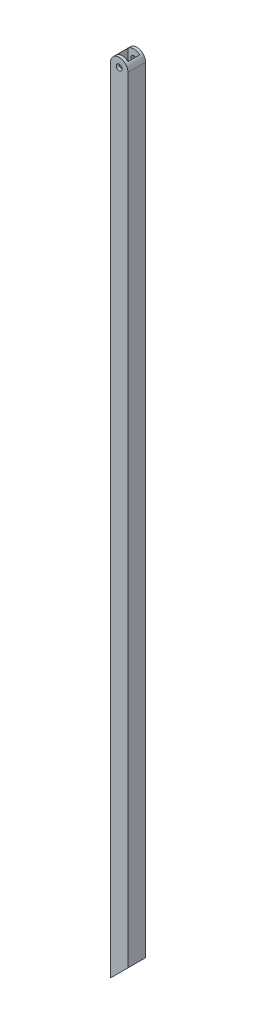
ISO-10303-21;
HEADER;
FILE_DESCRIPTION(('STEP AP214'),'2;1');
FILE_NAME('part.step','',(''),(''),'','','');
FILE_SCHEMA(('AUTOMOTIVE_DESIGN { 1 0 10303 214 1 1 1 1 }'));
ENDSEC;
DATA;
#1=APPLICATION_CONTEXT('core data for automotive mechanical design processes');
#2=APPLICATION_PROTOCOL_DEFINITION('international standard','automotive_design',2000,#1);
#3=PRODUCT_CONTEXT('',#1,'mechanical');
#4=PRODUCT('Part','Part','',(#3));
#5=PRODUCT_RELATED_PRODUCT_CATEGORY('part','',(#4));
#6=PRODUCT_DEFINITION_FORMATION('','',#4);
#7=PRODUCT_DEFINITION_CONTEXT('part definition',#1,'design');
#8=PRODUCT_DEFINITION('design','',#6,#7);
#9=PRODUCT_DEFINITION_SHAPE('','',#8);
#10=(LENGTH_UNIT() NAMED_UNIT(*) SI_UNIT(.MILLI.,.METRE.));
#11=(NAMED_UNIT(*) PLANE_ANGLE_UNIT() SI_UNIT($,.RADIAN.));
#12=(NAMED_UNIT(*) SI_UNIT($,.STERADIAN.) SOLID_ANGLE_UNIT());
#13=UNCERTAINTY_MEASURE_WITH_UNIT(LENGTH_MEASURE(1.E-05),#10,'distance_accuracy_value','');
#14=(GEOMETRIC_REPRESENTATION_CONTEXT(3) GLOBAL_UNCERTAINTY_ASSIGNED_CONTEXT((#13)) GLOBAL_UNIT_ASSIGNED_CONTEXT((#10,
#11,#12)) REPRESENTATION_CONTEXT('',''));
#15=CARTESIAN_POINT('',(0.,0.,0.));
#16=DIRECTION('',(0.,0.,1.));
#17=DIRECTION('',(1.,0.,0.));
#18=AXIS2_PLACEMENT_3D('',#15,#16,#17);
#19=CARTESIAN_POINT('',(0.,0.,19.05));
#20=DIRECTION('',(-0.707106781186549,0.707106781186546,0.));
#21=DIRECTION('',(-0.707106781186546,-0.707106781186549,0.));
#22=AXIS2_PLACEMENT_3D('',#19,#20,#21);
#23=PLANE('',#22);
#24=DIRECTION('',(0.707106781186546,0.707106781186549,0.));
#25=VECTOR('',#24,1.);
#26=CARTESIAN_POINT('',(0.,0.,0.));
#27=LINE('',#26,#25);
#28=CARTESIAN_POINT('',(0.,0.,0.));
#29=VERTEX_POINT('',#28);
#30=CARTESIAN_POINT('',(19.05,19.0500000000001,0.));
#31=VERTEX_POINT('',#30);
#32=EDGE_CURVE('E147',#29,#31,#27,.T.);
#33=ORIENTED_EDGE('',*,*,#32,.T.);
#34=DIRECTION('',(0.,0.,-1.));
#35=VECTOR('',#34,1.);
#36=CARTESIAN_POINT('',(19.05,19.0500000000001,19.05));
#37=LINE('',#36,#35);
#38=CARTESIAN_POINT('',(19.05,19.0500000000001,19.05));
#39=VERTEX_POINT('',#38);
#40=EDGE_CURVE('E128',#39,#31,#37,.T.);
#41=ORIENTED_EDGE('',*,*,#40,.F.);
#42=DIRECTION('',(0.707106781186546,0.707106781186549,0.));
#43=VECTOR('',#42,1.);
#44=CARTESIAN_POINT('',(0.,0.,19.05));
#45=LINE('',#44,#43);
#46=CARTESIAN_POINT('',(0.,0.,19.05));
#47=VERTEX_POINT('',#46);
#48=EDGE_CURVE('E86',#47,#39,#45,.T.);
#49=ORIENTED_EDGE('',*,*,#48,.F.);
#50=DIRECTION('',(0.,0.,-1.));
#51=VECTOR('',#50,1.);
#52=CARTESIAN_POINT('',(0.,0.,19.05));
#53=LINE('',#52,#51);
#54=EDGE_CURVE('E127',#47,#29,#53,.T.);
#55=ORIENTED_EDGE('',*,*,#54,.T.);
#56=EDGE_LOOP('',(#33,#41,#49,#55));
#57=FACE_BOUND('',#56,.T.);
#58=DIRECTION('',(0.,0.,-1.));
#59=VECTOR('',#58,1.);
#60=CARTESIAN_POINT('',(3.175,3.17500000000001,19.05));
#61=LINE('',#60,#59);
#62=CARTESIAN_POINT('',(3.17500000000004,3.17500000000012,15.875));
#63=VERTEX_POINT('',#62);
#64=CARTESIAN_POINT('',(3.175,3.17500000000001,3.175));
#65=VERTEX_POINT('',#64);
#66=EDGE_CURVE('E121',#63,#65,#61,.T.);
#67=ORIENTED_EDGE('',*,*,#66,.F.);
#68=DIRECTION('',(-0.707106781186546,-0.707106781186549,0.));
#69=VECTOR('',#68,1.);
#70=CARTESIAN_POINT('',(0.,0.,15.875));
#71=LINE('',#70,#69);
#72=CARTESIAN_POINT('',(15.875,15.8750000000003,15.875));
#73=VERTEX_POINT('',#72);
#74=EDGE_CURVE('E166',#73,#63,#71,.T.);
#75=ORIENTED_EDGE('',*,*,#74,.F.);
#76=DIRECTION('',(0.,0.,1.));
#77=VECTOR('',#76,1.);
#78=CARTESIAN_POINT('',(15.875,15.8750000000001,19.05));
#79=LINE('',#78,#77);
#80=CARTESIAN_POINT('',(15.8749999999999,15.8749999999997,3.175));
#81=VERTEX_POINT('',#80);
#82=EDGE_CURVE('E164',#81,#73,#79,.T.);
#83=ORIENTED_EDGE('',*,*,#82,.F.);
#84=DIRECTION('',(0.707106781186546,0.707106781186549,0.));
#85=VECTOR('',#84,1.);
#86=CARTESIAN_POINT('',(0.,0.,3.175));
#87=LINE('',#86,#85);
#88=EDGE_CURVE('E113',#65,#81,#87,.T.);
#89=ORIENTED_EDGE('',*,*,#88,.F.);
#90=EDGE_LOOP('',(#67,#75,#83,#89));
#91=FACE_BOUND('',#90,.T.);
#92=ADVANCED_FACE('F33',(#57,#91),#23,.F.);
#93=CARTESIAN_POINT('',(9.525,860.475,19.05));
#94=DIRECTION('',(0.,0.,-1.));
#95=DIRECTION('',(-1.,0.,0.));
#96=AXIS2_PLACEMENT_3D('',#93,#94,#95);
#97=CYLINDRICAL_SURFACE('',#96,9.525);
#98=CARTESIAN_POINT('',(9.525,860.475,0.));
#99=DIRECTION('',(0.,0.,1.));
#100=DIRECTION('',(1.,0.,0.));
#101=AXIS2_PLACEMENT_3D('',#98,#99,#100);
#102=CIRCLE('',#101,9.525);
#103=CARTESIAN_POINT('',(19.05,860.475,0.));
#104=VERTEX_POINT('',#103);
#105=CARTESIAN_POINT('',(0.,860.475,0.));
#106=VERTEX_POINT('',#105);
#107=EDGE_CURVE('E78',#104,#106,#102,.T.);
#108=ORIENTED_EDGE('',*,*,#107,.T.);
#109=DIRECTION('',(0.,0.,-1.));
#110=VECTOR('',#109,1.);
#111=CARTESIAN_POINT('',(0.,860.475,19.05));
#112=LINE('',#111,#110);
#113=CARTESIAN_POINT('',(0.,860.475,19.05));
#114=VERTEX_POINT('',#113);
#115=EDGE_CURVE('E141',#114,#106,#112,.T.);
#116=ORIENTED_EDGE('',*,*,#115,.F.);
#117=CARTESIAN_POINT('',(9.525,860.475,19.05));
#118=DIRECTION('',(0.,0.,1.));
#119=DIRECTION('',(1.,0.,0.));
#120=AXIS2_PLACEMENT_3D('',#117,#118,#119);
#121=CIRCLE('',#120,9.525);
#122=CARTESIAN_POINT('',(19.05,860.475,19.05));
#123=VERTEX_POINT('',#122);
#124=EDGE_CURVE('E57',#123,#114,#121,.T.);
#125=ORIENTED_EDGE('',*,*,#124,.F.);
#126=DIRECTION('',(0.,0.,-1.));
#127=VECTOR('',#126,1.);
#128=CARTESIAN_POINT('',(19.05,860.475,19.05));
#129=LINE('',#128,#127);
#130=EDGE_CURVE('E139',#123,#104,#129,.T.);
#131=ORIENTED_EDGE('',*,*,#130,.T.);
#132=EDGE_LOOP('',(#108,#116,#125,#131));
#133=FACE_BOUND('',#132,.T.);
#134=CARTESIAN_POINT('',(9.525,860.475,3.175));
#135=DIRECTION('',(0.,0.,1.));
#136=DIRECTION('',(1.,0.,0.));
#137=AXIS2_PLACEMENT_3D('',#134,#135,#136);
#138=CIRCLE('',#137,9.525);
#139=CARTESIAN_POINT('',(15.875,867.574515828562,3.175));
#140=VERTEX_POINT('',#139);
#141=CARTESIAN_POINT('',(3.175,867.574515828562,3.175));
#142=VERTEX_POINT('',#141);
#143=EDGE_CURVE('E106',#140,#142,#138,.T.);
#144=ORIENTED_EDGE('',*,*,#143,.F.);
#145=DIRECTION('',(0.,0.,-1.));
#146=VECTOR('',#145,1.);
#147=CARTESIAN_POINT('',(15.875,867.574515828562,19.05));
#148=LINE('',#147,#146);
#149=CARTESIAN_POINT('',(15.875,867.574515828562,15.875));
#150=VERTEX_POINT('',#149);
#151=EDGE_CURVE('E11',#150,#140,#148,.T.);
#152=ORIENTED_EDGE('',*,*,#151,.F.);
#153=CARTESIAN_POINT('',(9.525,860.475,15.875));
#154=DIRECTION('',(0.,0.,-1.));
#155=DIRECTION('',(-1.,0.,0.));
#156=AXIS2_PLACEMENT_3D('',#153,#154,#155);
#157=CIRCLE('',#156,9.525);
#158=CARTESIAN_POINT('',(3.175,867.574515828562,15.875));
#159=VERTEX_POINT('',#158);
#160=EDGE_CURVE('E126',#159,#150,#157,.T.);
#161=ORIENTED_EDGE('',*,*,#160,.F.);
#162=DIRECTION('',(0.,0.,-1.));
#163=VECTOR('',#162,1.);
#164=CARTESIAN_POINT('',(3.175,867.574515828562,19.05));
#165=LINE('',#164,#163);
#166=EDGE_CURVE('E41',#142,#159,#165,.F.);
#167=ORIENTED_EDGE('',*,*,#166,.F.);
#168=EDGE_LOOP('',(#144,#152,#161,#167));
#169=FACE_BOUND('',#168,.T.);
#170=ADVANCED_FACE('F125',(#133,#169),#97,.T.);
#171=CARTESIAN_POINT('',(9.525,860.475,19.05));
#172=DIRECTION('',(0.,0.,-1.));
#173=DIRECTION('',(-1.,0.,0.));
#174=AXIS2_PLACEMENT_3D('',#171,#172,#173);
#175=CYLINDRICAL_SURFACE('',#174,3.175);
#176=CARTESIAN_POINT('',(9.525,860.475,19.05));
#177=DIRECTION('',(0.,0.,1.));
#178=DIRECTION('',(1.,0.,0.));
#179=AXIS2_PLACEMENT_3D('',#176,#177,#178);
#180=CIRCLE('',#179,3.175);
#181=CARTESIAN_POINT('',(12.7,860.475,19.05));
#182=VERTEX_POINT('',#181);
#183=EDGE_CURVE('E152',#182,#182,#180,.T.);
#184=ORIENTED_EDGE('',*,*,#183,.T.);
#185=EDGE_LOOP('',(#184));
#186=FACE_BOUND('',#185,.T.);
#187=CARTESIAN_POINT('',(9.525,860.475,15.875));
#188=DIRECTION('',(0.,0.,-1.));
#189=DIRECTION('',(-1.,0.,0.));
#190=AXIS2_PLACEMENT_3D('',#187,#188,#189);
#191=CIRCLE('',#190,3.175);
#192=CARTESIAN_POINT('',(6.35,860.475,15.875));
#193=VERTEX_POINT('',#192);
#194=EDGE_CURVE('E131',#193,#193,#191,.T.);
#195=ORIENTED_EDGE('',*,*,#194,.T.);
#196=EDGE_LOOP('',(#195));
#197=FACE_BOUND('',#196,.T.);
#198=ADVANCED_FACE('F198',(#186,#197),#175,.F.);
#199=CARTESIAN_POINT('',(9.525,860.475,0.));
#200=DIRECTION('',(0.,0.,1.));
#201=DIRECTION('',(1.,0.,0.));
#202=AXIS2_PLACEMENT_3D('',#199,#200,#201);
#203=CIRCLE('',#202,3.175);
#204=CARTESIAN_POINT('',(12.7,860.475,0.));
#205=VERTEX_POINT('',#204);
#206=EDGE_CURVE('E158',#205,#205,#203,.T.);
#207=ORIENTED_EDGE('',*,*,#206,.F.);
#208=EDGE_LOOP('',(#207));
#209=FACE_BOUND('',#208,.T.);
#210=CARTESIAN_POINT('',(9.525,860.475,3.175));
#211=DIRECTION('',(0.,0.,1.));
#212=DIRECTION('',(1.,0.,0.));
#213=AXIS2_PLACEMENT_3D('',#210,#211,#212);
#214=CIRCLE('',#213,3.175);
#215=CARTESIAN_POINT('',(12.7,860.475,3.175));
#216=VERTEX_POINT('',#215);
#217=EDGE_CURVE('E114',#216,#216,#214,.T.);
#218=ORIENTED_EDGE('',*,*,#217,.T.);
#219=EDGE_LOOP('',(#218));
#220=FACE_BOUND('',#219,.T.);
#221=ADVANCED_FACE('F212',(#209,#220),#175,.F.);
#222=CARTESIAN_POINT('',(9.525,860.475,19.05));
#223=DIRECTION('',(0.,0.,1.));
#224=DIRECTION('',(1.,0.,0.));
#225=AXIS2_PLACEMENT_3D('',#222,#223,#224);
#226=PLANE('',#225);
#227=DIRECTION('',(0.,-1.,0.));
#228=VECTOR('',#227,1.);
#229=CARTESIAN_POINT('',(0.,0.,19.05));
#230=LINE('',#229,#228);
#231=EDGE_CURVE('E144',#114,#47,#230,.T.);
#232=ORIENTED_EDGE('',*,*,#231,.T.);
#233=ORIENTED_EDGE('',*,*,#48,.T.);
#234=DIRECTION('',(0.,1.,0.));
#235=VECTOR('',#234,1.);
#236=CARTESIAN_POINT('',(19.05,19.0500000000001,19.05));
#237=LINE('',#236,#235);
#238=EDGE_CURVE('E154',#39,#123,#237,.T.);
#239=ORIENTED_EDGE('',*,*,#238,.T.);
#240=ORIENTED_EDGE('',*,*,#124,.T.);
#241=EDGE_LOOP('',(#232,#233,#239,#240));
#242=FACE_BOUND('',#241,.T.);
#243=ORIENTED_EDGE('',*,*,#183,.F.);
#244=EDGE_LOOP('',(#243));
#245=FACE_BOUND('',#244,.T.);
#246=ADVANCED_FACE('F208',(#242,#245),#226,.T.);
#247=CARTESIAN_POINT('',(9.525,860.475,0.));
#248=DIRECTION('',(0.,0.,1.));
#249=DIRECTION('',(1.,0.,0.));
#250=AXIS2_PLACEMENT_3D('',#247,#248,#249);
#251=PLANE('',#250);
#252=DIRECTION('',(0.,-1.,0.));
#253=VECTOR('',#252,1.);
#254=CARTESIAN_POINT('',(0.,0.,0.));
#255=LINE('',#254,#253);
#256=EDGE_CURVE('E149',#106,#29,#255,.T.);
#257=ORIENTED_EDGE('',*,*,#256,.F.);
#258=ORIENTED_EDGE('',*,*,#107,.F.);
#259=DIRECTION('',(0.,1.,0.));
#260=VECTOR('',#259,1.);
#261=CARTESIAN_POINT('',(19.05,19.0500000000001,0.));
#262=LINE('',#261,#260);
#263=EDGE_CURVE('E145',#31,#104,#262,.T.);
#264=ORIENTED_EDGE('',*,*,#263,.F.);
#265=ORIENTED_EDGE('',*,*,#32,.F.);
#266=EDGE_LOOP('',(#257,#258,#264,#265));
#267=FACE_BOUND('',#266,.T.);
#268=ORIENTED_EDGE('',*,*,#206,.T.);
#269=EDGE_LOOP('',(#268));
#270=FACE_BOUND('',#269,.T.);
#271=ADVANCED_FACE('F205',(#267,#270),#251,.F.);
#272=CARTESIAN_POINT('',(0.,0.,19.05));
#273=DIRECTION('',(1.,0.,0.));
#274=DIRECTION('',(0.,0.,-1.));
#275=AXIS2_PLACEMENT_3D('',#272,#273,#274);
#276=PLANE('',#275);
#277=ORIENTED_EDGE('',*,*,#256,.T.);
#278=ORIENTED_EDGE('',*,*,#54,.F.);
#279=ORIENTED_EDGE('',*,*,#231,.F.);
#280=ORIENTED_EDGE('',*,*,#115,.T.);
#281=EDGE_LOOP('',(#277,#278,#279,#280));
#282=FACE_BOUND('',#281,.T.);
#283=ADVANCED_FACE('F35',(#282),#276,.F.);
#284=CARTESIAN_POINT('',(19.05,19.0500000000001,19.05));
#285=DIRECTION('',(-1.,0.,0.));
#286=DIRECTION('',(0.,-1.,0.));
#287=AXIS2_PLACEMENT_3D('',#284,#285,#286);
#288=PLANE('',#287);
#289=ORIENTED_EDGE('',*,*,#263,.T.);
#290=ORIENTED_EDGE('',*,*,#130,.F.);
#291=ORIENTED_EDGE('',*,*,#238,.F.);
#292=ORIENTED_EDGE('',*,*,#40,.T.);
#293=EDGE_LOOP('',(#289,#290,#291,#292));
#294=FACE_BOUND('',#293,.T.);
#295=ADVANCED_FACE('F201',(#294),#288,.F.);
#296=CARTESIAN_POINT('',(3.175,870.,3.175));
#297=DIRECTION('',(1.,0.,0.));
#298=DIRECTION('',(0.,0.,-1.));
#299=AXIS2_PLACEMENT_3D('',#296,#297,#298);
#300=PLANE('',#299);
#301=ORIENTED_EDGE('',*,*,#66,.T.);
#302=DIRECTION('',(0.,-1.,0.));
#303=VECTOR('',#302,1.);
#304=CARTESIAN_POINT('',(3.175,870.,3.175));
#305=LINE('',#304,#303);
#306=EDGE_CURVE('E48',#142,#65,#305,.T.);
#307=ORIENTED_EDGE('',*,*,#306,.F.);
#308=ORIENTED_EDGE('',*,*,#166,.T.);
#309=DIRECTION('',(0.,-1.,0.));
#310=VECTOR('',#309,1.);
#311=CARTESIAN_POINT('',(3.175,870.,15.875));
#312=LINE('',#311,#310);
#313=EDGE_CURVE('E135',#159,#63,#312,.T.);
#314=ORIENTED_EDGE('',*,*,#313,.T.);
#315=EDGE_LOOP('',(#301,#307,#308,#314));
#316=FACE_BOUND('',#315,.T.);
#317=ADVANCED_FACE('F117',(#316),#300,.T.);
#318=CARTESIAN_POINT('',(15.875,870.,3.175));
#319=DIRECTION('',(-1.,0.,0.));
#320=DIRECTION('',(0.,0.,1.));
#321=AXIS2_PLACEMENT_3D('',#318,#319,#320);
#322=PLANE('',#321);
#323=ORIENTED_EDGE('',*,*,#82,.T.);
#324=DIRECTION('',(0.,-1.,0.));
#325=VECTOR('',#324,1.);
#326=CARTESIAN_POINT('',(15.875,870.,15.875));
#327=LINE('',#326,#325);
#328=EDGE_CURVE('E171',#150,#73,#327,.T.);
#329=ORIENTED_EDGE('',*,*,#328,.F.);
#330=ORIENTED_EDGE('',*,*,#151,.T.);
#331=DIRECTION('',(0.,-1.,0.));
#332=VECTOR('',#331,1.);
#333=CARTESIAN_POINT('',(15.875,870.,3.175));
#334=LINE('',#333,#332);
#335=EDGE_CURVE('E109',#140,#81,#334,.T.);
#336=ORIENTED_EDGE('',*,*,#335,.T.);
#337=EDGE_LOOP('',(#323,#329,#330,#336));
#338=FACE_BOUND('',#337,.T.);
#339=ADVANCED_FACE('F176',(#338),#322,.T.);
#340=CARTESIAN_POINT('',(3.175,870.,15.875));
#341=DIRECTION('',(0.,0.,-1.));
#342=DIRECTION('',(-1.,0.,0.));
#343=AXIS2_PLACEMENT_3D('',#340,#341,#342);
#344=PLANE('',#343);
#345=ORIENTED_EDGE('',*,*,#194,.F.);
#346=EDGE_LOOP('',(#345));
#347=FACE_BOUND('',#346,.T.);
#348=ORIENTED_EDGE('',*,*,#74,.T.);
#349=ORIENTED_EDGE('',*,*,#313,.F.);
#350=ORIENTED_EDGE('',*,*,#160,.T.);
#351=ORIENTED_EDGE('',*,*,#328,.T.);
#352=EDGE_LOOP('',(#348,#349,#350,#351));
#353=FACE_BOUND('',#352,.T.);
#354=ADVANCED_FACE('F181',(#347,#353),#344,.T.);
#355=CARTESIAN_POINT('',(3.175,870.,3.175));
#356=DIRECTION('',(0.,0.,1.));
#357=DIRECTION('',(1.,0.,0.));
#358=AXIS2_PLACEMENT_3D('',#355,#356,#357);
#359=PLANE('',#358);
#360=ORIENTED_EDGE('',*,*,#217,.F.);
#361=EDGE_LOOP('',(#360));
#362=FACE_BOUND('',#361,.T.);
#363=ORIENTED_EDGE('',*,*,#88,.T.);
#364=ORIENTED_EDGE('',*,*,#335,.F.);
#365=ORIENTED_EDGE('',*,*,#143,.T.);
#366=ORIENTED_EDGE('',*,*,#306,.T.);
#367=EDGE_LOOP('',(#363,#364,#365,#366));
#368=FACE_BOUND('',#367,.T.);
#369=ADVANCED_FACE('F107',(#362,#368),#359,.T.);
#370=CLOSED_SHELL('',(#92,#170,#198,#221,#246,#271,#283,#295,#317,#339,#354,#369));
#371=MANIFOLD_SOLID_BREP('B2',#370);
#372=ADVANCED_BREP_SHAPE_REPRESENTATION('',(#18,#371),#14);
#373=SHAPE_DEFINITION_REPRESENTATION(#9,#372);
ENDSEC;
END-ISO-10303-21;
